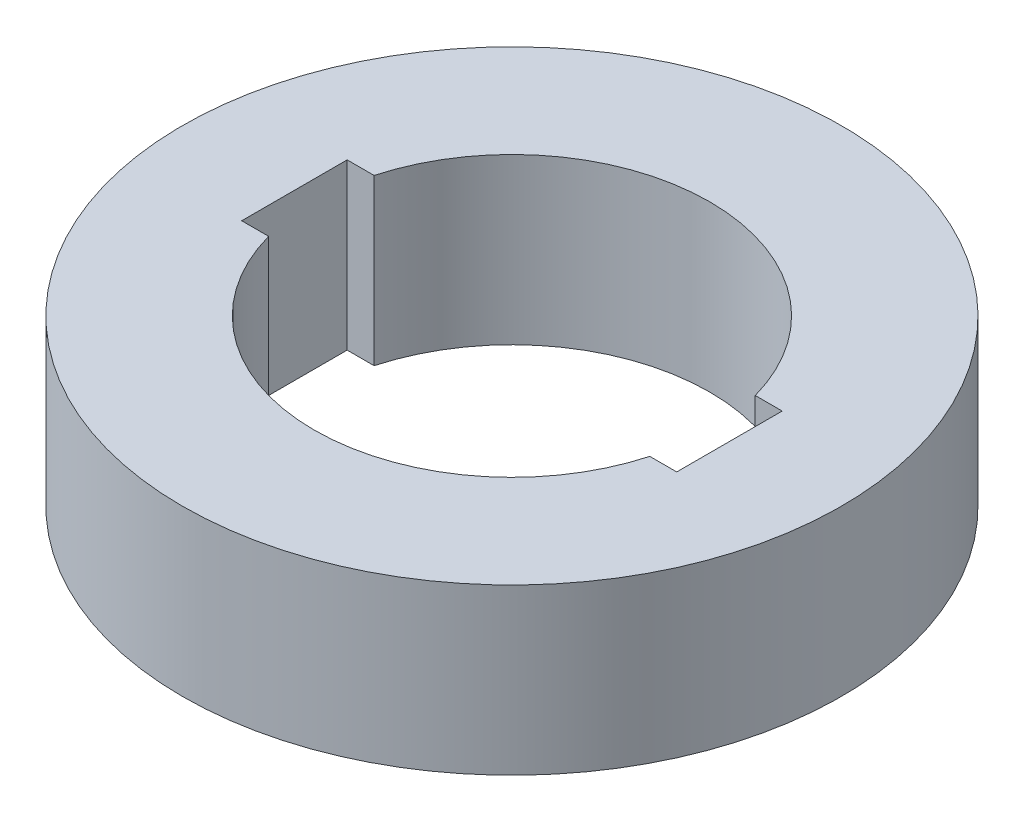
ISO-10303-21;
HEADER;
FILE_DESCRIPTION(('STEP AP214'),'2;1');
FILE_NAME('part.step','',(''),(''),'','','');
FILE_SCHEMA(('AUTOMOTIVE_DESIGN { 1 0 10303 214 1 1 1 1 }'));
ENDSEC;
DATA;
#1=APPLICATION_CONTEXT('core data for automotive mechanical design processes');
#2=APPLICATION_PROTOCOL_DEFINITION('international standard','automotive_design',2000,#1);
#3=PRODUCT_CONTEXT('',#1,'mechanical');
#4=PRODUCT('Part','Part','',(#3));
#5=PRODUCT_RELATED_PRODUCT_CATEGORY('part','',(#4));
#6=PRODUCT_DEFINITION_FORMATION('','',#4);
#7=PRODUCT_DEFINITION_CONTEXT('part definition',#1,'design');
#8=PRODUCT_DEFINITION('design','',#6,#7);
#9=PRODUCT_DEFINITION_SHAPE('','',#8);
#10=(LENGTH_UNIT() NAMED_UNIT(*) SI_UNIT(.MILLI.,.METRE.));
#11=(NAMED_UNIT(*) PLANE_ANGLE_UNIT() SI_UNIT($,.RADIAN.));
#12=(NAMED_UNIT(*) SI_UNIT($,.STERADIAN.) SOLID_ANGLE_UNIT());
#13=UNCERTAINTY_MEASURE_WITH_UNIT(LENGTH_MEASURE(1.E-05),#10,'distance_accuracy_value','');
#14=(GEOMETRIC_REPRESENTATION_CONTEXT(3) GLOBAL_UNCERTAINTY_ASSIGNED_CONTEXT((#13)) GLOBAL_UNIT_ASSIGNED_CONTEXT((#10,
#11,#12)) REPRESENTATION_CONTEXT('',''));
#15=CARTESIAN_POINT('',(0.,0.,0.));
#16=DIRECTION('',(0.,0.,1.));
#17=DIRECTION('',(1.,0.,0.));
#18=AXIS2_PLACEMENT_3D('',#15,#16,#17);
#19=CARTESIAN_POINT('',(0.,25.,0.));
#20=DIRECTION('',(0.,1.,0.));
#21=DIRECTION('',(0.,0.,1.));
#22=AXIS2_PLACEMENT_3D('',#19,#20,#21);
#23=PLANE('',#22);
#24=CARTESIAN_POINT('',(0.,25.,0.));
#25=DIRECTION('',(0.,1.,0.));
#26=DIRECTION('',(0.,0.,1.));
#27=AXIS2_PLACEMENT_3D('',#24,#25,#26);
#28=CIRCLE('',#27,50.);
#29=CARTESIAN_POINT('',(0.,25.,50.));
#30=VERTEX_POINT('',#29);
#31=EDGE_CURVE('E11',#30,#30,#28,.T.);
#32=ORIENTED_EDGE('',*,*,#31,.T.);
#33=EDGE_LOOP('',(#32));
#34=FACE_BOUND('',#33,.T.);
#35=DIRECTION('',(1.,0.,0.));
#36=VECTOR('',#35,1.);
#37=CARTESIAN_POINT('',(-33.,25.,8.));
#38=LINE('',#37,#36);
#39=CARTESIAN_POINT('',(-33.,25.,8.));
#40=VERTEX_POINT('',#39);
#41=CARTESIAN_POINT('',(-28.9136645896019,25.,7.99999999999999));
#42=VERTEX_POINT('',#41);
#43=EDGE_CURVE('E120',#40,#42,#38,.T.);
#44=ORIENTED_EDGE('',*,*,#43,.F.);
#45=DIRECTION('',(0.,0.,1.));
#46=VECTOR('',#45,1.);
#47=CARTESIAN_POINT('',(-33.,25.,-8.));
#48=LINE('',#47,#46);
#49=CARTESIAN_POINT('',(-33.,25.,-8.));
#50=VERTEX_POINT('',#49);
#51=EDGE_CURVE('E111',#50,#40,#48,.T.);
#52=ORIENTED_EDGE('',*,*,#51,.F.);
#53=DIRECTION('',(-1.,0.,0.));
#54=VECTOR('',#53,1.);
#55=CARTESIAN_POINT('',(-33.,25.,-8.));
#56=LINE('',#55,#54);
#57=CARTESIAN_POINT('',(-28.9136645896019,25.,-8.));
#58=VERTEX_POINT('',#57);
#59=EDGE_CURVE('E151',#58,#50,#56,.T.);
#60=ORIENTED_EDGE('',*,*,#59,.F.);
#61=CARTESIAN_POINT('',(0.,25.,0.));
#62=DIRECTION('',(0.,1.,0.));
#63=DIRECTION('',(0.,0.,1.));
#64=AXIS2_PLACEMENT_3D('',#61,#62,#63);
#65=CIRCLE('',#64,30.);
#66=CARTESIAN_POINT('',(28.9136645896019,25.,-8.));
#67=VERTEX_POINT('',#66);
#68=EDGE_CURVE('E148',#67,#58,#65,.T.);
#69=ORIENTED_EDGE('',*,*,#68,.F.);
#70=DIRECTION('',(-1.,0.,0.));
#71=VECTOR('',#70,1.);
#72=CARTESIAN_POINT('',(28.9136645896019,25.,-8.));
#73=LINE('',#72,#71);
#74=CARTESIAN_POINT('',(33.,25.,-8.));
#75=VERTEX_POINT('',#74);
#76=EDGE_CURVE('E145',#75,#67,#73,.T.);
#77=ORIENTED_EDGE('',*,*,#76,.F.);
#78=DIRECTION('',(0.,0.,-1.));
#79=VECTOR('',#78,1.);
#80=CARTESIAN_POINT('',(33.,25.,-8.));
#81=LINE('',#80,#79);
#82=CARTESIAN_POINT('',(33.,25.,8.));
#83=VERTEX_POINT('',#82);
#84=EDGE_CURVE('E142',#83,#75,#81,.T.);
#85=ORIENTED_EDGE('',*,*,#84,.F.);
#86=DIRECTION('',(1.,0.,0.));
#87=VECTOR('',#86,1.);
#88=CARTESIAN_POINT('',(28.9136645896019,25.,8.));
#89=LINE('',#88,#87);
#90=CARTESIAN_POINT('',(28.9136645896019,25.,8.));
#91=VERTEX_POINT('',#90);
#92=EDGE_CURVE('E137',#91,#83,#89,.T.);
#93=ORIENTED_EDGE('',*,*,#92,.F.);
#94=CARTESIAN_POINT('',(0.,25.,0.));
#95=DIRECTION('',(0.,1.,0.));
#96=DIRECTION('',(0.,0.,1.));
#97=AXIS2_PLACEMENT_3D('',#94,#95,#96);
#98=CIRCLE('',#97,30.);
#99=EDGE_CURVE('E133',#42,#91,#98,.T.);
#100=ORIENTED_EDGE('',*,*,#99,.F.);
#101=EDGE_LOOP('',(#44,#52,#60,#69,#77,#85,#93,#100));
#102=FACE_BOUND('',#101,.T.);
#103=ADVANCED_FACE('F45',(#34,#102),#23,.T.);
#104=CARTESIAN_POINT('',(0.,0.,0.));
#105=DIRECTION('',(0.,1.,0.));
#106=DIRECTION('',(0.,0.,1.));
#107=AXIS2_PLACEMENT_3D('',#104,#105,#106);
#108=PLANE('',#107);
#109=CARTESIAN_POINT('',(0.,0.,0.));
#110=DIRECTION('',(0.,1.,0.));
#111=DIRECTION('',(0.,0.,1.));
#112=AXIS2_PLACEMENT_3D('',#109,#110,#111);
#113=CIRCLE('',#112,50.);
#114=CARTESIAN_POINT('',(0.,0.,50.));
#115=VERTEX_POINT('',#114);
#116=EDGE_CURVE('E49',#115,#115,#113,.T.);
#117=ORIENTED_EDGE('',*,*,#116,.F.);
#118=EDGE_LOOP('',(#117));
#119=FACE_BOUND('',#118,.T.);
#120=DIRECTION('',(0.,0.,1.));
#121=VECTOR('',#120,1.);
#122=CARTESIAN_POINT('',(-33.,0.,-8.));
#123=LINE('',#122,#121);
#124=CARTESIAN_POINT('',(-33.,0.,-8.));
#125=VERTEX_POINT('',#124);
#126=CARTESIAN_POINT('',(-33.,0.,8.));
#127=VERTEX_POINT('',#126);
#128=EDGE_CURVE('E69',#125,#127,#123,.T.);
#129=ORIENTED_EDGE('',*,*,#128,.T.);
#130=DIRECTION('',(1.,0.,0.));
#131=VECTOR('',#130,1.);
#132=CARTESIAN_POINT('',(-33.,0.,8.));
#133=LINE('',#132,#131);
#134=CARTESIAN_POINT('',(-28.9136645896019,0.,7.99999999999999));
#135=VERTEX_POINT('',#134);
#136=EDGE_CURVE('E127',#127,#135,#133,.T.);
#137=ORIENTED_EDGE('',*,*,#136,.T.);
#138=CARTESIAN_POINT('',(0.,0.,0.));
#139=DIRECTION('',(0.,1.,0.));
#140=DIRECTION('',(0.,0.,1.));
#141=AXIS2_PLACEMENT_3D('',#138,#139,#140);
#142=CIRCLE('',#141,30.);
#143=CARTESIAN_POINT('',(28.9136645896019,0.,8.));
#144=VERTEX_POINT('',#143);
#145=EDGE_CURVE('E158',#135,#144,#142,.T.);
#146=ORIENTED_EDGE('',*,*,#145,.T.);
#147=DIRECTION('',(1.,0.,0.));
#148=VECTOR('',#147,1.);
#149=CARTESIAN_POINT('',(28.9136645896019,0.,8.));
#150=LINE('',#149,#148);
#151=CARTESIAN_POINT('',(33.,0.,8.));
#152=VERTEX_POINT('',#151);
#153=EDGE_CURVE('E162',#144,#152,#150,.T.);
#154=ORIENTED_EDGE('',*,*,#153,.T.);
#155=DIRECTION('',(0.,0.,-1.));
#156=VECTOR('',#155,1.);
#157=CARTESIAN_POINT('',(33.,0.,-8.));
#158=LINE('',#157,#156);
#159=CARTESIAN_POINT('',(33.,0.,-8.));
#160=VERTEX_POINT('',#159);
#161=EDGE_CURVE('E166',#152,#160,#158,.T.);
#162=ORIENTED_EDGE('',*,*,#161,.T.);
#163=DIRECTION('',(-1.,0.,0.));
#164=VECTOR('',#163,1.);
#165=CARTESIAN_POINT('',(28.9136645896019,0.,-8.));
#166=LINE('',#165,#164);
#167=CARTESIAN_POINT('',(28.9136645896019,0.,-8.));
#168=VERTEX_POINT('',#167);
#169=EDGE_CURVE('E170',#160,#168,#166,.T.);
#170=ORIENTED_EDGE('',*,*,#169,.T.);
#171=CARTESIAN_POINT('',(0.,0.,0.));
#172=DIRECTION('',(0.,1.,0.));
#173=DIRECTION('',(0.,0.,1.));
#174=AXIS2_PLACEMENT_3D('',#171,#172,#173);
#175=CIRCLE('',#174,30.);
#176=CARTESIAN_POINT('',(-28.9136645896019,0.,-8.));
#177=VERTEX_POINT('',#176);
#178=EDGE_CURVE('E174',#168,#177,#175,.T.);
#179=ORIENTED_EDGE('',*,*,#178,.T.);
#180=DIRECTION('',(-1.,0.,0.));
#181=VECTOR('',#180,1.);
#182=CARTESIAN_POINT('',(-33.,0.,-8.));
#183=LINE('',#182,#181);
#184=EDGE_CURVE('E121',#177,#125,#183,.T.);
#185=ORIENTED_EDGE('',*,*,#184,.T.);
#186=EDGE_LOOP('',(#129,#137,#146,#154,#162,#170,#179,#185));
#187=FACE_BOUND('',#186,.T.);
#188=ADVANCED_FACE('F204',(#119,#187),#108,.F.);
#189=CARTESIAN_POINT('',(0.,25.,0.));
#190=DIRECTION('',(0.,-1.,0.));
#191=DIRECTION('',(0.,0.,-1.));
#192=AXIS2_PLACEMENT_3D('',#189,#190,#191);
#193=CYLINDRICAL_SURFACE('',#192,50.);
#194=ORIENTED_EDGE('',*,*,#31,.F.);
#195=EDGE_LOOP('',(#194));
#196=FACE_BOUND('',#195,.T.);
#197=ORIENTED_EDGE('',*,*,#116,.T.);
#198=EDGE_LOOP('',(#197));
#199=FACE_BOUND('',#198,.T.);
#200=ADVANCED_FACE('F47',(#196,#199),#193,.T.);
#201=CARTESIAN_POINT('',(-33.,25.,-8.));
#202=DIRECTION('',(1.,0.,0.));
#203=DIRECTION('',(0.,0.,-1.));
#204=AXIS2_PLACEMENT_3D('',#201,#202,#203);
#205=PLANE('',#204);
#206=ORIENTED_EDGE('',*,*,#128,.F.);
#207=DIRECTION('',(0.,-1.,0.));
#208=VECTOR('',#207,1.);
#209=CARTESIAN_POINT('',(-33.,25.,-8.));
#210=LINE('',#209,#208);
#211=EDGE_CURVE('E115',#50,#125,#210,.T.);
#212=ORIENTED_EDGE('',*,*,#211,.F.);
#213=ORIENTED_EDGE('',*,*,#51,.T.);
#214=DIRECTION('',(0.,-1.,0.));
#215=VECTOR('',#214,1.);
#216=CARTESIAN_POINT('',(-33.,25.,8.));
#217=LINE('',#216,#215);
#218=EDGE_CURVE('E114',#40,#127,#217,.T.);
#219=ORIENTED_EDGE('',*,*,#218,.T.);
#220=EDGE_LOOP('',(#206,#212,#213,#219));
#221=FACE_BOUND('',#220,.T.);
#222=ADVANCED_FACE('F113',(#221),#205,.T.);
#223=CARTESIAN_POINT('',(-33.,25.,8.));
#224=DIRECTION('',(0.,0.,-1.));
#225=DIRECTION('',(-1.,0.,0.));
#226=AXIS2_PLACEMENT_3D('',#223,#224,#225);
#227=PLANE('',#226);
#228=ORIENTED_EDGE('',*,*,#136,.F.);
#229=ORIENTED_EDGE('',*,*,#218,.F.);
#230=ORIENTED_EDGE('',*,*,#43,.T.);
#231=DIRECTION('',(0.,-1.,0.));
#232=VECTOR('',#231,1.);
#233=CARTESIAN_POINT('',(-28.9136645896019,25.,7.99999999999999));
#234=LINE('',#233,#232);
#235=EDGE_CURVE('E129',#42,#135,#234,.T.);
#236=ORIENTED_EDGE('',*,*,#235,.T.);
#237=EDGE_LOOP('',(#228,#229,#230,#236));
#238=FACE_BOUND('',#237,.T.);
#239=ADVANCED_FACE('F124',(#238),#227,.T.);
#240=CARTESIAN_POINT('',(0.,25.,0.));
#241=DIRECTION('',(0.,-1.,0.));
#242=DIRECTION('',(0.,0.,-1.));
#243=AXIS2_PLACEMENT_3D('',#240,#241,#242);
#244=CYLINDRICAL_SURFACE('',#243,30.);
#245=ORIENTED_EDGE('',*,*,#145,.F.);
#246=ORIENTED_EDGE('',*,*,#235,.F.);
#247=ORIENTED_EDGE('',*,*,#99,.T.);
#248=DIRECTION('',(0.,-1.,0.));
#249=VECTOR('',#248,1.);
#250=CARTESIAN_POINT('',(28.9136645896019,25.,8.));
#251=LINE('',#250,#249);
#252=EDGE_CURVE('E194',#91,#144,#251,.T.);
#253=ORIENTED_EDGE('',*,*,#252,.T.);
#254=EDGE_LOOP('',(#245,#246,#247,#253));
#255=FACE_BOUND('',#254,.T.);
#256=ADVANCED_FACE('F200',(#255),#244,.F.);
#257=CARTESIAN_POINT('',(28.9136645896019,25.,8.));
#258=DIRECTION('',(0.,0.,-1.));
#259=DIRECTION('',(-1.,0.,0.));
#260=AXIS2_PLACEMENT_3D('',#257,#258,#259);
#261=PLANE('',#260);
#262=ORIENTED_EDGE('',*,*,#153,.F.);
#263=ORIENTED_EDGE('',*,*,#252,.F.);
#264=ORIENTED_EDGE('',*,*,#92,.T.);
#265=DIRECTION('',(0.,-1.,0.));
#266=VECTOR('',#265,1.);
#267=CARTESIAN_POINT('',(33.,25.,8.));
#268=LINE('',#267,#266);
#269=EDGE_CURVE('E191',#83,#152,#268,.T.);
#270=ORIENTED_EDGE('',*,*,#269,.T.);
#271=EDGE_LOOP('',(#262,#263,#264,#270));
#272=FACE_BOUND('',#271,.T.);
#273=ADVANCED_FACE('F222',(#272),#261,.T.);
#274=CARTESIAN_POINT('',(33.,25.,-8.));
#275=DIRECTION('',(-1.,0.,0.));
#276=DIRECTION('',(0.,0.,1.));
#277=AXIS2_PLACEMENT_3D('',#274,#275,#276);
#278=PLANE('',#277);
#279=ORIENTED_EDGE('',*,*,#161,.F.);
#280=ORIENTED_EDGE('',*,*,#269,.F.);
#281=ORIENTED_EDGE('',*,*,#84,.T.);
#282=DIRECTION('',(0.,-1.,0.));
#283=VECTOR('',#282,1.);
#284=CARTESIAN_POINT('',(33.,25.,-8.));
#285=LINE('',#284,#283);
#286=EDGE_CURVE('E188',#75,#160,#285,.T.);
#287=ORIENTED_EDGE('',*,*,#286,.T.);
#288=EDGE_LOOP('',(#279,#280,#281,#287));
#289=FACE_BOUND('',#288,.T.);
#290=ADVANCED_FACE('F219',(#289),#278,.T.);
#291=CARTESIAN_POINT('',(28.9136645896019,25.,-8.));
#292=DIRECTION('',(0.,0.,1.));
#293=DIRECTION('',(1.,0.,0.));
#294=AXIS2_PLACEMENT_3D('',#291,#292,#293);
#295=PLANE('',#294);
#296=ORIENTED_EDGE('',*,*,#169,.F.);
#297=ORIENTED_EDGE('',*,*,#286,.F.);
#298=ORIENTED_EDGE('',*,*,#76,.T.);
#299=DIRECTION('',(0.,-1.,0.));
#300=VECTOR('',#299,1.);
#301=CARTESIAN_POINT('',(28.9136645896019,25.,-8.));
#302=LINE('',#301,#300);
#303=EDGE_CURVE('E185',#67,#168,#302,.T.);
#304=ORIENTED_EDGE('',*,*,#303,.T.);
#305=EDGE_LOOP('',(#296,#297,#298,#304));
#306=FACE_BOUND('',#305,.T.);
#307=ADVANCED_FACE('F215',(#306),#295,.T.);
#308=CARTESIAN_POINT('',(0.,25.,0.));
#309=DIRECTION('',(0.,-1.,0.));
#310=DIRECTION('',(0.,0.,-1.));
#311=AXIS2_PLACEMENT_3D('',#308,#309,#310);
#312=CYLINDRICAL_SURFACE('',#311,30.);
#313=ORIENTED_EDGE('',*,*,#178,.F.);
#314=ORIENTED_EDGE('',*,*,#303,.F.);
#315=ORIENTED_EDGE('',*,*,#68,.T.);
#316=DIRECTION('',(0.,-1.,0.));
#317=VECTOR('',#316,1.);
#318=CARTESIAN_POINT('',(-28.9136645896019,25.,-8.));
#319=LINE('',#318,#317);
#320=EDGE_CURVE('E61',#58,#177,#319,.T.);
#321=ORIENTED_EDGE('',*,*,#320,.T.);
#322=EDGE_LOOP('',(#313,#314,#315,#321));
#323=FACE_BOUND('',#322,.T.);
#324=ADVANCED_FACE('F212',(#323),#312,.F.);
#325=CARTESIAN_POINT('',(-33.,25.,-8.));
#326=DIRECTION('',(0.,0.,1.));
#327=DIRECTION('',(1.,0.,0.));
#328=AXIS2_PLACEMENT_3D('',#325,#326,#327);
#329=PLANE('',#328);
#330=ORIENTED_EDGE('',*,*,#184,.F.);
#331=ORIENTED_EDGE('',*,*,#320,.F.);
#332=ORIENTED_EDGE('',*,*,#59,.T.);
#333=ORIENTED_EDGE('',*,*,#211,.T.);
#334=EDGE_LOOP('',(#330,#331,#332,#333));
#335=FACE_BOUND('',#334,.T.);
#336=ADVANCED_FACE('F206',(#335),#329,.T.);
#337=CLOSED_SHELL('',(#103,#188,#200,#222,#239,#256,#273,#290,#307,#324,#336));
#338=MANIFOLD_SOLID_BREP('B2',#337);
#339=ADVANCED_BREP_SHAPE_REPRESENTATION('',(#18,#338),#14);
#340=SHAPE_DEFINITION_REPRESENTATION(#9,#339);
ENDSEC;
END-ISO-10303-21;
